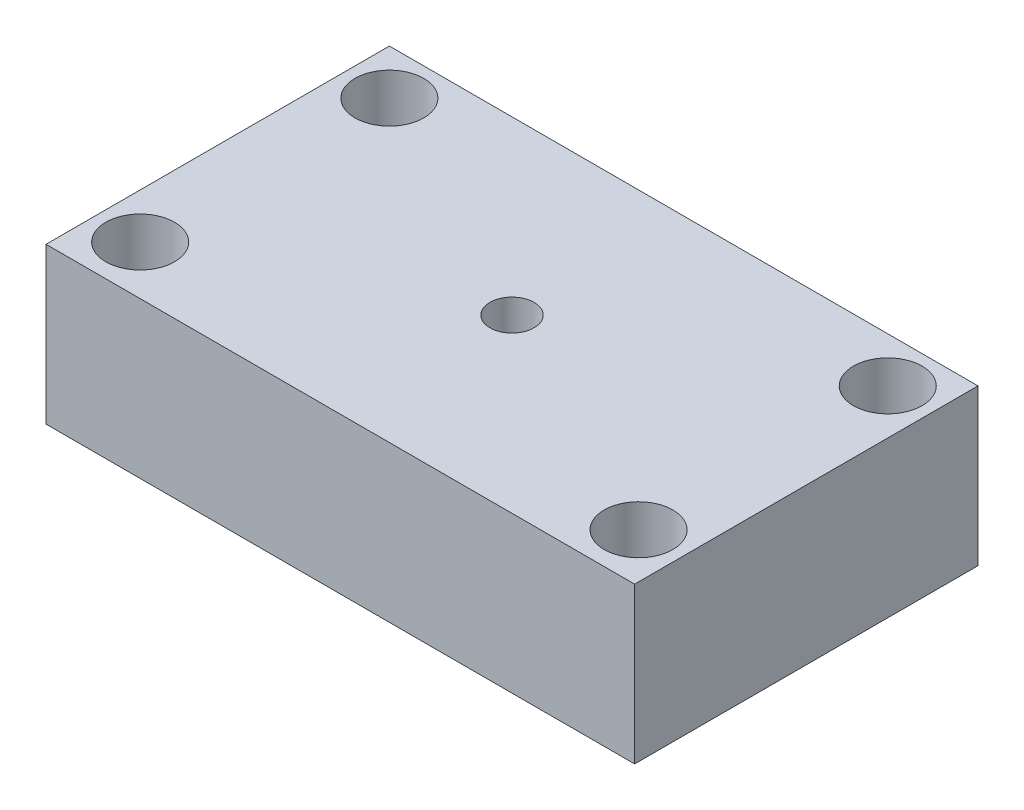
ISO-10303-21;
HEADER;
FILE_DESCRIPTION(('STEP AP214'),'2;1');
FILE_NAME('part.step','',(''),(''),'','','');
FILE_SCHEMA(('AUTOMOTIVE_DESIGN { 1 0 10303 214 1 1 1 1 }'));
ENDSEC;
DATA;
#1=APPLICATION_CONTEXT('core data for automotive mechanical design processes');
#2=APPLICATION_PROTOCOL_DEFINITION('international standard','automotive_design',2000,#1);
#3=PRODUCT_CONTEXT('',#1,'mechanical');
#4=PRODUCT('Part','Part','',(#3));
#5=PRODUCT_RELATED_PRODUCT_CATEGORY('part','',(#4));
#6=PRODUCT_DEFINITION_FORMATION('','',#4);
#7=PRODUCT_DEFINITION_CONTEXT('part definition',#1,'design');
#8=PRODUCT_DEFINITION('design','',#6,#7);
#9=PRODUCT_DEFINITION_SHAPE('','',#8);
#10=(LENGTH_UNIT() NAMED_UNIT(*) SI_UNIT(.MILLI.,.METRE.));
#11=(NAMED_UNIT(*) PLANE_ANGLE_UNIT() SI_UNIT($,.RADIAN.));
#12=(NAMED_UNIT(*) SI_UNIT($,.STERADIAN.) SOLID_ANGLE_UNIT());
#13=UNCERTAINTY_MEASURE_WITH_UNIT(LENGTH_MEASURE(1.E-05),#10,'distance_accuracy_value','');
#14=(GEOMETRIC_REPRESENTATION_CONTEXT(3) GLOBAL_UNCERTAINTY_ASSIGNED_CONTEXT((#13)) GLOBAL_UNIT_ASSIGNED_CONTEXT((#10,
#11,#12)) REPRESENTATION_CONTEXT('',''));
#15=CARTESIAN_POINT('',(0.,0.,0.));
#16=DIRECTION('',(0.,0.,1.));
#17=DIRECTION('',(1.,0.,0.));
#18=AXIS2_PLACEMENT_3D('',#15,#16,#17);
#19=CARTESIAN_POINT('',(0.,15.875,0.));
#20=DIRECTION('',(0.,-1.,0.));
#21=DIRECTION('',(0.,0.,-1.));
#22=AXIS2_PLACEMENT_3D('',#19,#20,#21);
#23=PLANE('',#22);
#24=DIRECTION('',(0.,0.,1.));
#25=VECTOR('',#24,1.);
#26=CARTESIAN_POINT('',(0.,15.875,0.));
#27=LINE('',#26,#25);
#28=CARTESIAN_POINT('',(0.,15.875,-35.));
#29=VERTEX_POINT('',#28);
#30=CARTESIAN_POINT('',(0.,15.875,0.));
#31=VERTEX_POINT('',#30);
#32=EDGE_CURVE('E95',#29,#31,#27,.T.);
#33=ORIENTED_EDGE('',*,*,#32,.T.);
#34=DIRECTION('',(1.,0.,0.));
#35=VECTOR('',#34,1.);
#36=CARTESIAN_POINT('',(0.,15.875,0.));
#37=LINE('',#36,#35);
#38=CARTESIAN_POINT('',(60.,15.875,0.));
#39=VERTEX_POINT('',#38);
#40=EDGE_CURVE('E90',#31,#39,#37,.T.);
#41=ORIENTED_EDGE('',*,*,#40,.T.);
#42=DIRECTION('',(0.,0.,-1.));
#43=VECTOR('',#42,1.);
#44=CARTESIAN_POINT('',(60.,15.875,0.));
#45=LINE('',#44,#43);
#46=CARTESIAN_POINT('',(60.,15.875,-35.));
#47=VERTEX_POINT('',#46);
#48=EDGE_CURVE('E93',#39,#47,#45,.T.);
#49=ORIENTED_EDGE('',*,*,#48,.T.);
#50=DIRECTION('',(-1.,0.,0.));
#51=VECTOR('',#50,1.);
#52=CARTESIAN_POINT('',(0.,15.875,-35.));
#53=LINE('',#52,#51);
#54=EDGE_CURVE('E60',#47,#29,#53,.T.);
#55=ORIENTED_EDGE('',*,*,#54,.T.);
#56=EDGE_LOOP('',(#33,#41,#49,#55));
#57=FACE_BOUND('',#56,.T.);
#58=CARTESIAN_POINT('',(4.6,15.875,-30.4));
#59=DIRECTION('',(0.,1.,0.));
#60=DIRECTION('',(0.,0.,1.));
#61=AXIS2_PLACEMENT_3D('',#58,#59,#60);
#62=CIRCLE('',#61,3.5);
#63=CARTESIAN_POINT('',(4.6,15.875,-26.9));
#64=VERTEX_POINT('',#63);
#65=EDGE_CURVE('E115',#64,#64,#62,.T.);
#66=ORIENTED_EDGE('',*,*,#65,.F.);
#67=EDGE_LOOP('',(#66));
#68=FACE_BOUND('',#67,.T.);
#69=CARTESIAN_POINT('',(55.4,15.875,-30.4));
#70=DIRECTION('',(0.,1.,0.));
#71=DIRECTION('',(0.,0.,1.));
#72=AXIS2_PLACEMENT_3D('',#69,#70,#71);
#73=CIRCLE('',#72,3.5);
#74=CARTESIAN_POINT('',(55.4,15.875,-26.9));
#75=VERTEX_POINT('',#74);
#76=EDGE_CURVE('E137',#75,#75,#73,.T.);
#77=ORIENTED_EDGE('',*,*,#76,.F.);
#78=EDGE_LOOP('',(#77));
#79=FACE_BOUND('',#78,.T.);
#80=CARTESIAN_POINT('',(4.6,15.875,-5.));
#81=DIRECTION('',(0.,1.,0.));
#82=DIRECTION('',(0.,0.,1.));
#83=AXIS2_PLACEMENT_3D('',#80,#81,#82);
#84=CIRCLE('',#83,3.5);
#85=CARTESIAN_POINT('',(4.6,15.875,-1.5));
#86=VERTEX_POINT('',#85);
#87=EDGE_CURVE('E145',#86,#86,#84,.T.);
#88=ORIENTED_EDGE('',*,*,#87,.F.);
#89=EDGE_LOOP('',(#88));
#90=FACE_BOUND('',#89,.T.);
#91=CARTESIAN_POINT('',(55.4,15.875,-5.));
#92=DIRECTION('',(0.,1.,0.));
#93=DIRECTION('',(0.,0.,1.));
#94=AXIS2_PLACEMENT_3D('',#91,#92,#93);
#95=CIRCLE('',#94,3.5);
#96=CARTESIAN_POINT('',(55.4,15.875,-1.5));
#97=VERTEX_POINT('',#96);
#98=EDGE_CURVE('E153',#97,#97,#95,.T.);
#99=ORIENTED_EDGE('',*,*,#98,.F.);
#100=EDGE_LOOP('',(#99));
#101=FACE_BOUND('',#100,.T.);
#102=CARTESIAN_POINT('',(30.,15.875,-17.5));
#103=DIRECTION('',(0.,1.,0.));
#104=DIRECTION('',(0.,0.,1.));
#105=AXIS2_PLACEMENT_3D('',#102,#103,#104);
#106=CIRCLE('',#105,2.25);
#107=CARTESIAN_POINT('',(30.,15.875,-15.25));
#108=VERTEX_POINT('',#107);
#109=EDGE_CURVE('E161',#108,#108,#106,.T.);
#110=ORIENTED_EDGE('',*,*,#109,.F.);
#111=EDGE_LOOP('',(#110));
#112=FACE_BOUND('',#111,.T.);
#113=ADVANCED_FACE('F42',(#57,#68,#79,#90,#101,#112),#23,.F.);
#114=CARTESIAN_POINT('',(0.,0.,0.));
#115=DIRECTION('',(0.,-1.,0.));
#116=DIRECTION('',(0.,0.,-1.));
#117=AXIS2_PLACEMENT_3D('',#114,#115,#116);
#118=PLANE('',#117);
#119=CARTESIAN_POINT('',(55.4,0.,-5.));
#120=DIRECTION('',(0.,1.,0.));
#121=DIRECTION('',(0.,0.,1.));
#122=AXIS2_PLACEMENT_3D('',#119,#120,#121);
#123=CIRCLE('',#122,3.5);
#124=CARTESIAN_POINT('',(55.4,0.,-1.5));
#125=VERTEX_POINT('',#124);
#126=EDGE_CURVE('E157',#125,#125,#123,.T.);
#127=ORIENTED_EDGE('',*,*,#126,.T.);
#128=EDGE_LOOP('',(#127));
#129=FACE_BOUND('',#128,.T.);
#130=CARTESIAN_POINT('',(55.4,0.,-30.4));
#131=DIRECTION('',(0.,1.,0.));
#132=DIRECTION('',(0.,0.,1.));
#133=AXIS2_PLACEMENT_3D('',#130,#131,#132);
#134=CIRCLE('',#133,3.5);
#135=CARTESIAN_POINT('',(55.4,0.,-26.9));
#136=VERTEX_POINT('',#135);
#137=EDGE_CURVE('E141',#136,#136,#134,.T.);
#138=ORIENTED_EDGE('',*,*,#137,.T.);
#139=EDGE_LOOP('',(#138));
#140=FACE_BOUND('',#139,.T.);
#141=DIRECTION('',(0.,0.,1.));
#142=VECTOR('',#141,1.);
#143=CARTESIAN_POINT('',(0.,0.,0.));
#144=LINE('',#143,#142);
#145=CARTESIAN_POINT('',(0.,0.,-35.));
#146=VERTEX_POINT('',#145);
#147=CARTESIAN_POINT('',(0.,0.,0.));
#148=VERTEX_POINT('',#147);
#149=EDGE_CURVE('E111',#146,#148,#144,.T.);
#150=ORIENTED_EDGE('',*,*,#149,.F.);
#151=DIRECTION('',(-1.,0.,0.));
#152=VECTOR('',#151,1.);
#153=CARTESIAN_POINT('',(0.,0.,-35.));
#154=LINE('',#153,#152);
#155=CARTESIAN_POINT('',(60.,0.,-35.));
#156=VERTEX_POINT('',#155);
#157=EDGE_CURVE('E83',#156,#146,#154,.T.);
#158=ORIENTED_EDGE('',*,*,#157,.F.);
#159=DIRECTION('',(0.,0.,-1.));
#160=VECTOR('',#159,1.);
#161=CARTESIAN_POINT('',(60.,0.,0.));
#162=LINE('',#161,#160);
#163=CARTESIAN_POINT('',(60.,0.,0.));
#164=VERTEX_POINT('',#163);
#165=EDGE_CURVE('E77',#164,#156,#162,.T.);
#166=ORIENTED_EDGE('',*,*,#165,.F.);
#167=DIRECTION('',(1.,0.,0.));
#168=VECTOR('',#167,1.);
#169=CARTESIAN_POINT('',(0.,0.,0.));
#170=LINE('',#169,#168);
#171=EDGE_CURVE('E100',#148,#164,#170,.T.);
#172=ORIENTED_EDGE('',*,*,#171,.F.);
#173=EDGE_LOOP('',(#150,#158,#166,#172));
#174=FACE_BOUND('',#173,.T.);
#175=CARTESIAN_POINT('',(4.6,0.,-30.4));
#176=DIRECTION('',(0.,1.,0.));
#177=DIRECTION('',(0.,0.,1.));
#178=AXIS2_PLACEMENT_3D('',#175,#176,#177);
#179=CIRCLE('',#178,3.5);
#180=CARTESIAN_POINT('',(4.6,0.,-26.9));
#181=VERTEX_POINT('',#180);
#182=EDGE_CURVE('E133',#181,#181,#179,.T.);
#183=ORIENTED_EDGE('',*,*,#182,.T.);
#184=EDGE_LOOP('',(#183));
#185=FACE_BOUND('',#184,.T.);
#186=CARTESIAN_POINT('',(4.6,0.,-5.));
#187=DIRECTION('',(0.,1.,0.));
#188=DIRECTION('',(0.,0.,1.));
#189=AXIS2_PLACEMENT_3D('',#186,#187,#188);
#190=CIRCLE('',#189,3.5);
#191=CARTESIAN_POINT('',(4.6,0.,-1.5));
#192=VERTEX_POINT('',#191);
#193=EDGE_CURVE('E149',#192,#192,#190,.T.);
#194=ORIENTED_EDGE('',*,*,#193,.T.);
#195=EDGE_LOOP('',(#194));
#196=FACE_BOUND('',#195,.T.);
#197=CARTESIAN_POINT('',(30.,0.,-17.5));
#198=DIRECTION('',(0.,1.,0.));
#199=DIRECTION('',(0.,0.,1.));
#200=AXIS2_PLACEMENT_3D('',#197,#198,#199);
#201=CIRCLE('',#200,2.25);
#202=CARTESIAN_POINT('',(30.,0.,-15.25));
#203=VERTEX_POINT('',#202);
#204=EDGE_CURVE('E165',#203,#203,#201,.T.);
#205=ORIENTED_EDGE('',*,*,#204,.T.);
#206=EDGE_LOOP('',(#205));
#207=FACE_BOUND('',#206,.T.);
#208=ADVANCED_FACE('F128',(#129,#140,#174,#185,#196,#207),#118,.T.);
#209=CARTESIAN_POINT('',(0.,15.875,0.));
#210=DIRECTION('',(1.,0.,0.));
#211=DIRECTION('',(0.,0.,-1.));
#212=AXIS2_PLACEMENT_3D('',#209,#210,#211);
#213=PLANE('',#212);
#214=ORIENTED_EDGE('',*,*,#149,.T.);
#215=DIRECTION('',(0.,-1.,0.));
#216=VECTOR('',#215,1.);
#217=CARTESIAN_POINT('',(0.,15.875,0.));
#218=LINE('',#217,#216);
#219=EDGE_CURVE('E11',#31,#148,#218,.T.);
#220=ORIENTED_EDGE('',*,*,#219,.F.);
#221=ORIENTED_EDGE('',*,*,#32,.F.);
#222=DIRECTION('',(0.,-1.,0.));
#223=VECTOR('',#222,1.);
#224=CARTESIAN_POINT('',(0.,15.875,-35.));
#225=LINE('',#224,#223);
#226=EDGE_CURVE('E107',#29,#146,#225,.T.);
#227=ORIENTED_EDGE('',*,*,#226,.T.);
#228=EDGE_LOOP('',(#214,#220,#221,#227));
#229=FACE_BOUND('',#228,.T.);
#230=ADVANCED_FACE('F44',(#229),#213,.F.);
#231=CARTESIAN_POINT('',(0.,15.875,0.));
#232=DIRECTION('',(0.,0.,-1.));
#233=DIRECTION('',(-1.,0.,0.));
#234=AXIS2_PLACEMENT_3D('',#231,#232,#233);
#235=PLANE('',#234);
#236=ORIENTED_EDGE('',*,*,#171,.T.);
#237=DIRECTION('',(0.,-1.,0.));
#238=VECTOR('',#237,1.);
#239=CARTESIAN_POINT('',(60.,15.875,0.));
#240=LINE('',#239,#238);
#241=EDGE_CURVE('E52',#39,#164,#240,.T.);
#242=ORIENTED_EDGE('',*,*,#241,.F.);
#243=ORIENTED_EDGE('',*,*,#40,.F.);
#244=ORIENTED_EDGE('',*,*,#219,.T.);
#245=EDGE_LOOP('',(#236,#242,#243,#244));
#246=FACE_BOUND('',#245,.T.);
#247=ADVANCED_FACE('F99',(#246),#235,.F.);
#248=CARTESIAN_POINT('',(60.,15.875,0.));
#249=DIRECTION('',(-1.,0.,0.));
#250=DIRECTION('',(0.,0.,1.));
#251=AXIS2_PLACEMENT_3D('',#248,#249,#250);
#252=PLANE('',#251);
#253=ORIENTED_EDGE('',*,*,#165,.T.);
#254=DIRECTION('',(0.,-1.,0.));
#255=VECTOR('',#254,1.);
#256=CARTESIAN_POINT('',(60.,15.875,-35.));
#257=LINE('',#256,#255);
#258=EDGE_CURVE('E102',#47,#156,#257,.T.);
#259=ORIENTED_EDGE('',*,*,#258,.F.);
#260=ORIENTED_EDGE('',*,*,#48,.F.);
#261=ORIENTED_EDGE('',*,*,#241,.T.);
#262=EDGE_LOOP('',(#253,#259,#260,#261));
#263=FACE_BOUND('',#262,.T.);
#264=ADVANCED_FACE('F103',(#263),#252,.F.);
#265=CARTESIAN_POINT('',(0.,15.875,-35.));
#266=DIRECTION('',(0.,0.,1.));
#267=DIRECTION('',(1.,0.,0.));
#268=AXIS2_PLACEMENT_3D('',#265,#266,#267);
#269=PLANE('',#268);
#270=ORIENTED_EDGE('',*,*,#157,.T.);
#271=ORIENTED_EDGE('',*,*,#226,.F.);
#272=ORIENTED_EDGE('',*,*,#54,.F.);
#273=ORIENTED_EDGE('',*,*,#258,.T.);
#274=EDGE_LOOP('',(#270,#271,#272,#273));
#275=FACE_BOUND('',#274,.T.);
#276=ADVANCED_FACE('F125',(#275),#269,.F.);
#277=CARTESIAN_POINT('',(4.6,15.875,-30.4));
#278=DIRECTION('',(0.,-1.,0.));
#279=DIRECTION('',(0.,0.,-1.));
#280=AXIS2_PLACEMENT_3D('',#277,#278,#279);
#281=CYLINDRICAL_SURFACE('',#280,3.5);
#282=ORIENTED_EDGE('',*,*,#65,.T.);
#283=EDGE_LOOP('',(#282));
#284=FACE_BOUND('',#283,.T.);
#285=ORIENTED_EDGE('',*,*,#182,.F.);
#286=EDGE_LOOP('',(#285));
#287=FACE_BOUND('',#286,.T.);
#288=ADVANCED_FACE('F184',(#284,#287),#281,.F.);
#289=CARTESIAN_POINT('',(55.4,15.875,-30.4));
#290=DIRECTION('',(0.,-1.,0.));
#291=DIRECTION('',(0.,0.,-1.));
#292=AXIS2_PLACEMENT_3D('',#289,#290,#291);
#293=CYLINDRICAL_SURFACE('',#292,3.5);
#294=ORIENTED_EDGE('',*,*,#76,.T.);
#295=EDGE_LOOP('',(#294));
#296=FACE_BOUND('',#295,.T.);
#297=ORIENTED_EDGE('',*,*,#137,.F.);
#298=EDGE_LOOP('',(#297));
#299=FACE_BOUND('',#298,.T.);
#300=ADVANCED_FACE('F238',(#296,#299),#293,.F.);
#301=CARTESIAN_POINT('',(4.6,15.875,-5.));
#302=DIRECTION('',(0.,-1.,0.));
#303=DIRECTION('',(0.,0.,-1.));
#304=AXIS2_PLACEMENT_3D('',#301,#302,#303);
#305=CYLINDRICAL_SURFACE('',#304,3.5);
#306=ORIENTED_EDGE('',*,*,#87,.T.);
#307=EDGE_LOOP('',(#306));
#308=FACE_BOUND('',#307,.T.);
#309=ORIENTED_EDGE('',*,*,#193,.F.);
#310=EDGE_LOOP('',(#309));
#311=FACE_BOUND('',#310,.T.);
#312=ADVANCED_FACE('F247',(#308,#311),#305,.F.);
#313=CARTESIAN_POINT('',(55.4,15.875,-5.));
#314=DIRECTION('',(0.,-1.,0.));
#315=DIRECTION('',(0.,0.,-1.));
#316=AXIS2_PLACEMENT_3D('',#313,#314,#315);
#317=CYLINDRICAL_SURFACE('',#316,3.5);
#318=ORIENTED_EDGE('',*,*,#98,.T.);
#319=EDGE_LOOP('',(#318));
#320=FACE_BOUND('',#319,.T.);
#321=ORIENTED_EDGE('',*,*,#126,.F.);
#322=EDGE_LOOP('',(#321));
#323=FACE_BOUND('',#322,.T.);
#324=ADVANCED_FACE('F256',(#320,#323),#317,.F.);
#325=CARTESIAN_POINT('',(30.,15.875,-17.5));
#326=DIRECTION('',(0.,-1.,0.));
#327=DIRECTION('',(0.,0.,-1.));
#328=AXIS2_PLACEMENT_3D('',#325,#326,#327);
#329=CYLINDRICAL_SURFACE('',#328,2.25);
#330=ORIENTED_EDGE('',*,*,#109,.T.);
#331=EDGE_LOOP('',(#330));
#332=FACE_BOUND('',#331,.T.);
#333=ORIENTED_EDGE('',*,*,#204,.F.);
#334=EDGE_LOOP('',(#333));
#335=FACE_BOUND('',#334,.T.);
#336=ADVANCED_FACE('F173',(#332,#335),#329,.F.);
#337=CLOSED_SHELL('',(#113,#208,#230,#247,#264,#276,#288,#300,#312,#324,#336));
#338=MANIFOLD_SOLID_BREP('B2',#337);
#339=ADVANCED_BREP_SHAPE_REPRESENTATION('',(#18,#338),#14);
#340=SHAPE_DEFINITION_REPRESENTATION(#9,#339);
ENDSEC;
END-ISO-10303-21;
